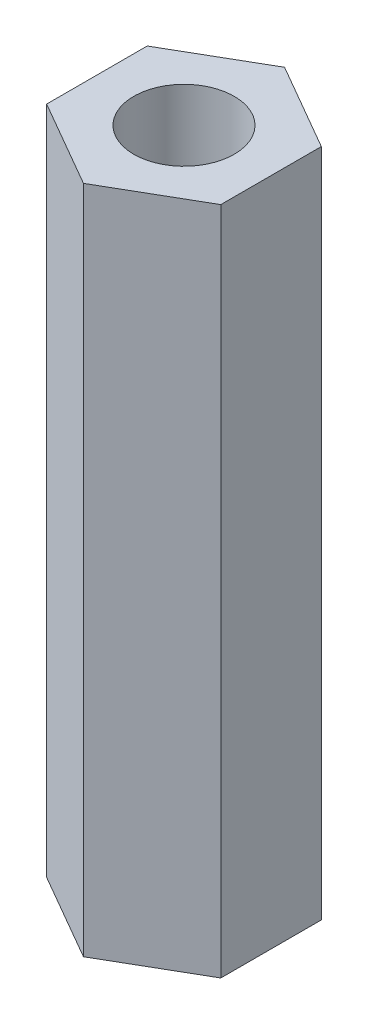
ISO-10303-21;
HEADER;
FILE_DESCRIPTION(('STEP AP214'),'2;1');
FILE_NAME('part.step','',(''),(''),'','','');
FILE_SCHEMA(('AUTOMOTIVE_DESIGN { 1 0 10303 214 1 1 1 1 }'));
ENDSEC;
DATA;
#1=APPLICATION_CONTEXT('core data for automotive mechanical design processes');
#2=APPLICATION_PROTOCOL_DEFINITION('international standard','automotive_design',2000,#1);
#3=PRODUCT_CONTEXT('',#1,'mechanical');
#4=PRODUCT('Part','Part','',(#3));
#5=PRODUCT_RELATED_PRODUCT_CATEGORY('part','',(#4));
#6=PRODUCT_DEFINITION_FORMATION('','',#4);
#7=PRODUCT_DEFINITION_CONTEXT('part definition',#1,'design');
#8=PRODUCT_DEFINITION('design','',#6,#7);
#9=PRODUCT_DEFINITION_SHAPE('','',#8);
#10=(LENGTH_UNIT() NAMED_UNIT(*) SI_UNIT(.MILLI.,.METRE.));
#11=(NAMED_UNIT(*) PLANE_ANGLE_UNIT() SI_UNIT($,.RADIAN.));
#12=(NAMED_UNIT(*) SI_UNIT($,.STERADIAN.) SOLID_ANGLE_UNIT());
#13=UNCERTAINTY_MEASURE_WITH_UNIT(LENGTH_MEASURE(1.E-05),#10,'distance_accuracy_value','');
#14=(GEOMETRIC_REPRESENTATION_CONTEXT(3) GLOBAL_UNCERTAINTY_ASSIGNED_CONTEXT((#13)) GLOBAL_UNIT_ASSIGNED_CONTEXT((#10,
#11,#12)) REPRESENTATION_CONTEXT('',''));
#15=CARTESIAN_POINT('',(0.,0.,0.));
#16=DIRECTION('',(0.,0.,1.));
#17=DIRECTION('',(1.,0.,0.));
#18=AXIS2_PLACEMENT_3D('',#15,#16,#17);
#19=CARTESIAN_POINT('',(0.,20.,0.));
#20=DIRECTION('',(0.,1.,0.));
#21=DIRECTION('',(0.,0.,1.));
#22=AXIS2_PLACEMENT_3D('',#19,#20,#21);
#23=PLANE('',#22);
#24=DIRECTION('',(-0.866025403784439,0.,-0.499999999999999));
#25=VECTOR('',#24,1.);
#26=CARTESIAN_POINT('',(2.6,20.,-1.50111069989303));
#27=LINE('',#26,#25);
#28=CARTESIAN_POINT('',(2.6,20.,-1.50111069989303));
#29=VERTEX_POINT('',#28);
#30=CARTESIAN_POINT('',(0.,20.,-3.00222139978605));
#31=VERTEX_POINT('',#30);
#32=EDGE_CURVE('E150',#29,#31,#27,.T.);
#33=ORIENTED_EDGE('',*,*,#32,.T.);
#34=DIRECTION('',(-0.866025403784438,0.,0.500000000000001));
#35=VECTOR('',#34,1.);
#36=CARTESIAN_POINT('',(0.,20.,-3.00222139978605));
#37=LINE('',#36,#35);
#38=CARTESIAN_POINT('',(-2.6,20.,-1.50111069989303));
#39=VERTEX_POINT('',#38);
#40=EDGE_CURVE('E98',#31,#39,#37,.T.);
#41=ORIENTED_EDGE('',*,*,#40,.T.);
#42=DIRECTION('',(0.,0.,1.));
#43=VECTOR('',#42,1.);
#44=CARTESIAN_POINT('',(-2.6,20.,-1.50111069989303));
#45=LINE('',#44,#43);
#46=CARTESIAN_POINT('',(-2.6,20.,1.50111069989303));
#47=VERTEX_POINT('',#46);
#48=EDGE_CURVE('E111',#39,#47,#45,.T.);
#49=ORIENTED_EDGE('',*,*,#48,.T.);
#50=DIRECTION('',(0.866025403784437,0.,0.500000000000003));
#51=VECTOR('',#50,1.);
#52=CARTESIAN_POINT('',(-2.6,20.,1.50111069989303));
#53=LINE('',#52,#51);
#54=CARTESIAN_POINT('',(0.,20.,3.00222139978606));
#55=VERTEX_POINT('',#54);
#56=EDGE_CURVE('E105',#47,#55,#53,.T.);
#57=ORIENTED_EDGE('',*,*,#56,.T.);
#58=DIRECTION('',(0.866025403784438,0.,-0.5));
#59=VECTOR('',#58,1.);
#60=CARTESIAN_POINT('',(0.,20.,3.00222139978606));
#61=LINE('',#60,#59);
#62=CARTESIAN_POINT('',(2.6,20.,1.50111069989303));
#63=VERTEX_POINT('',#62);
#64=EDGE_CURVE('E109',#55,#63,#61,.T.);
#65=ORIENTED_EDGE('',*,*,#64,.T.);
#66=DIRECTION('',(0.,0.,-1.));
#67=VECTOR('',#66,1.);
#68=CARTESIAN_POINT('',(2.6,20.,1.50111069989303));
#69=LINE('',#68,#67);
#70=EDGE_CURVE('E61',#63,#29,#69,.T.);
#71=ORIENTED_EDGE('',*,*,#70,.T.);
#72=EDGE_LOOP('',(#33,#41,#49,#57,#65,#71));
#73=FACE_BOUND('',#72,.T.);
#74=CARTESIAN_POINT('',(0.,20.,0.));
#75=DIRECTION('',(0.,1.,0.));
#76=DIRECTION('',(0.,0.,1.));
#77=AXIS2_PLACEMENT_3D('',#74,#75,#76);
#78=CIRCLE('',#77,1.5);
#79=CARTESIAN_POINT('',(0.,20.,1.5));
#80=VERTEX_POINT('',#79);
#81=EDGE_CURVE('E138',#80,#80,#78,.T.);
#82=ORIENTED_EDGE('',*,*,#81,.F.);
#83=EDGE_LOOP('',(#82));
#84=FACE_BOUND('',#83,.T.);
#85=ADVANCED_FACE('F43',(#73,#84),#23,.T.);
#86=CARTESIAN_POINT('',(0.,0.,0.));
#87=DIRECTION('',(0.,1.,0.));
#88=DIRECTION('',(0.,0.,1.));
#89=AXIS2_PLACEMENT_3D('',#86,#87,#88);
#90=PLANE('',#89);
#91=DIRECTION('',(-0.866025403784439,0.,-0.499999999999999));
#92=VECTOR('',#91,1.);
#93=CARTESIAN_POINT('',(2.6,0.,-1.50111069989303));
#94=LINE('',#93,#92);
#95=CARTESIAN_POINT('',(2.6,0.,-1.50111069989303));
#96=VERTEX_POINT('',#95);
#97=CARTESIAN_POINT('',(0.,0.,-3.00222139978605));
#98=VERTEX_POINT('',#97);
#99=EDGE_CURVE('E133',#96,#98,#94,.T.);
#100=ORIENTED_EDGE('',*,*,#99,.F.);
#101=DIRECTION('',(0.,0.,-1.));
#102=VECTOR('',#101,1.);
#103=CARTESIAN_POINT('',(2.6,0.,1.50111069989303));
#104=LINE('',#103,#102);
#105=CARTESIAN_POINT('',(2.6,0.,1.50111069989303));
#106=VERTEX_POINT('',#105);
#107=EDGE_CURVE('E90',#106,#96,#104,.T.);
#108=ORIENTED_EDGE('',*,*,#107,.F.);
#109=DIRECTION('',(0.866025403784438,0.,-0.5));
#110=VECTOR('',#109,1.);
#111=CARTESIAN_POINT('',(0.,0.,3.00222139978606));
#112=LINE('',#111,#110);
#113=CARTESIAN_POINT('',(0.,0.,3.00222139978606));
#114=VERTEX_POINT('',#113);
#115=EDGE_CURVE('E84',#114,#106,#112,.T.);
#116=ORIENTED_EDGE('',*,*,#115,.F.);
#117=DIRECTION('',(0.866025403784437,0.,0.500000000000003));
#118=VECTOR('',#117,1.);
#119=CARTESIAN_POINT('',(-2.6,0.,1.50111069989303));
#120=LINE('',#119,#118);
#121=CARTESIAN_POINT('',(-2.6,0.,1.50111069989303));
#122=VERTEX_POINT('',#121);
#123=EDGE_CURVE('E120',#122,#114,#120,.T.);
#124=ORIENTED_EDGE('',*,*,#123,.F.);
#125=DIRECTION('',(0.,0.,1.));
#126=VECTOR('',#125,1.);
#127=CARTESIAN_POINT('',(-2.6,0.,-1.50111069989303));
#128=LINE('',#127,#126);
#129=CARTESIAN_POINT('',(-2.6,0.,-1.50111069989303));
#130=VERTEX_POINT('',#129);
#131=EDGE_CURVE('E141',#130,#122,#128,.T.);
#132=ORIENTED_EDGE('',*,*,#131,.F.);
#133=DIRECTION('',(-0.866025403784438,0.,0.500000000000001));
#134=VECTOR('',#133,1.);
#135=CARTESIAN_POINT('',(0.,0.,-3.00222139978605));
#136=LINE('',#135,#134);
#137=EDGE_CURVE('E137',#98,#130,#136,.T.);
#138=ORIENTED_EDGE('',*,*,#137,.F.);
#139=EDGE_LOOP('',(#100,#108,#116,#124,#132,#138));
#140=FACE_BOUND('',#139,.T.);
#141=CARTESIAN_POINT('',(0.,0.,0.));
#142=DIRECTION('',(0.,1.,0.));
#143=DIRECTION('',(0.,0.,1.));
#144=AXIS2_PLACEMENT_3D('',#141,#142,#143);
#145=CIRCLE('',#144,1.5);
#146=CARTESIAN_POINT('',(0.,0.,1.5));
#147=VERTEX_POINT('',#146);
#148=EDGE_CURVE('E265',#147,#147,#145,.T.);
#149=ORIENTED_EDGE('',*,*,#148,.T.);
#150=EDGE_LOOP('',(#149));
#151=FACE_BOUND('',#150,.T.);
#152=ADVANCED_FACE('F163',(#140,#151),#90,.F.);
#153=CARTESIAN_POINT('',(2.6,20.,-1.50111069989303));
#154=DIRECTION('',(-0.499999999999999,0.,0.866025403784439));
#155=DIRECTION('',(0.866025403784439,0.,0.499999999999999));
#156=AXIS2_PLACEMENT_3D('',#153,#154,#155);
#157=PLANE('',#156);
#158=ORIENTED_EDGE('',*,*,#99,.T.);
#159=DIRECTION('',(0.,-1.,0.));
#160=VECTOR('',#159,1.);
#161=CARTESIAN_POINT('',(0.,20.,-3.00222139978605));
#162=LINE('',#161,#160);
#163=EDGE_CURVE('E11',#31,#98,#162,.T.);
#164=ORIENTED_EDGE('',*,*,#163,.F.);
#165=ORIENTED_EDGE('',*,*,#32,.F.);
#166=DIRECTION('',(0.,-1.,0.));
#167=VECTOR('',#166,1.);
#168=CARTESIAN_POINT('',(2.6,20.,-1.50111069989303));
#169=LINE('',#168,#167);
#170=EDGE_CURVE('E129',#29,#96,#169,.T.);
#171=ORIENTED_EDGE('',*,*,#170,.T.);
#172=EDGE_LOOP('',(#158,#164,#165,#171));
#173=FACE_BOUND('',#172,.T.);
#174=ADVANCED_FACE('F45',(#173),#157,.F.);
#175=CARTESIAN_POINT('',(0.,20.,-3.00222139978605));
#176=DIRECTION('',(0.500000000000001,0.,0.866025403784438));
#177=DIRECTION('',(0.866025403784438,0.,-0.500000000000001));
#178=AXIS2_PLACEMENT_3D('',#175,#176,#177);
#179=PLANE('',#178);
#180=ORIENTED_EDGE('',*,*,#137,.T.);
#181=DIRECTION('',(0.,-1.,0.));
#182=VECTOR('',#181,1.);
#183=CARTESIAN_POINT('',(-2.6,20.,-1.50111069989303));
#184=LINE('',#183,#182);
#185=EDGE_CURVE('E53',#39,#130,#184,.T.);
#186=ORIENTED_EDGE('',*,*,#185,.F.);
#187=ORIENTED_EDGE('',*,*,#40,.F.);
#188=ORIENTED_EDGE('',*,*,#163,.T.);
#189=EDGE_LOOP('',(#180,#186,#187,#188));
#190=FACE_BOUND('',#189,.T.);
#191=ADVANCED_FACE('F188',(#190),#179,.F.);
#192=CARTESIAN_POINT('',(-2.6,20.,-1.50111069989303));
#193=DIRECTION('',(1.,0.,0.));
#194=DIRECTION('',(0.,0.,-1.));
#195=AXIS2_PLACEMENT_3D('',#192,#193,#194);
#196=PLANE('',#195);
#197=ORIENTED_EDGE('',*,*,#131,.T.);
#198=DIRECTION('',(0.,-1.,0.));
#199=VECTOR('',#198,1.);
#200=CARTESIAN_POINT('',(-2.6,20.,1.50111069989303));
#201=LINE('',#200,#199);
#202=EDGE_CURVE('E122',#47,#122,#201,.T.);
#203=ORIENTED_EDGE('',*,*,#202,.F.);
#204=ORIENTED_EDGE('',*,*,#48,.F.);
#205=ORIENTED_EDGE('',*,*,#185,.T.);
#206=EDGE_LOOP('',(#197,#203,#204,#205));
#207=FACE_BOUND('',#206,.T.);
#208=ADVANCED_FACE('F160',(#207),#196,.F.);
#209=CARTESIAN_POINT('',(-2.6,20.,1.50111069989303));
#210=DIRECTION('',(0.500000000000003,0.,-0.866025403784437));
#211=DIRECTION('',(-0.866025403784437,0.,-0.500000000000003));
#212=AXIS2_PLACEMENT_3D('',#209,#210,#211);
#213=PLANE('',#212);
#214=ORIENTED_EDGE('',*,*,#123,.T.);
#215=DIRECTION('',(0.,-1.,0.));
#216=VECTOR('',#215,1.);
#217=CARTESIAN_POINT('',(0.,20.,3.00222139978606));
#218=LINE('',#217,#216);
#219=EDGE_CURVE('E117',#55,#114,#218,.T.);
#220=ORIENTED_EDGE('',*,*,#219,.F.);
#221=ORIENTED_EDGE('',*,*,#56,.F.);
#222=ORIENTED_EDGE('',*,*,#202,.T.);
#223=EDGE_LOOP('',(#214,#220,#221,#222));
#224=FACE_BOUND('',#223,.T.);
#225=ADVANCED_FACE('F118',(#224),#213,.F.);
#226=CARTESIAN_POINT('',(0.,20.,3.00222139978606));
#227=DIRECTION('',(-0.5,0.,-0.866025403784438));
#228=DIRECTION('',(-0.866025403784439,0.,0.5));
#229=AXIS2_PLACEMENT_3D('',#226,#227,#228);
#230=PLANE('',#229);
#231=ORIENTED_EDGE('',*,*,#115,.T.);
#232=DIRECTION('',(0.,-1.,0.));
#233=VECTOR('',#232,1.);
#234=CARTESIAN_POINT('',(2.6,20.,1.50111069989303));
#235=LINE('',#234,#233);
#236=EDGE_CURVE('E123',#63,#106,#235,.T.);
#237=ORIENTED_EDGE('',*,*,#236,.F.);
#238=ORIENTED_EDGE('',*,*,#64,.F.);
#239=ORIENTED_EDGE('',*,*,#219,.T.);
#240=EDGE_LOOP('',(#231,#237,#238,#239));
#241=FACE_BOUND('',#240,.T.);
#242=ADVANCED_FACE('F125',(#241),#230,.F.);
#243=CARTESIAN_POINT('',(2.6,20.,1.50111069989303));
#244=DIRECTION('',(-1.,0.,0.));
#245=DIRECTION('',(0.,0.,1.));
#246=AXIS2_PLACEMENT_3D('',#243,#244,#245);
#247=PLANE('',#246);
#248=ORIENTED_EDGE('',*,*,#107,.T.);
#249=ORIENTED_EDGE('',*,*,#170,.F.);
#250=ORIENTED_EDGE('',*,*,#70,.F.);
#251=ORIENTED_EDGE('',*,*,#236,.T.);
#252=EDGE_LOOP('',(#248,#249,#250,#251));
#253=FACE_BOUND('',#252,.T.);
#254=ADVANCED_FACE('F168',(#253),#247,.F.);
#255=CARTESIAN_POINT('',(0.,20.,0.));
#256=DIRECTION('',(0.,-1.,0.));
#257=DIRECTION('',(0.,0.,-1.));
#258=AXIS2_PLACEMENT_3D('',#255,#256,#257);
#259=CYLINDRICAL_SURFACE('',#258,1.5);
#260=ORIENTED_EDGE('',*,*,#81,.T.);
#261=EDGE_LOOP('',(#260));
#262=FACE_BOUND('',#261,.T.);
#263=ORIENTED_EDGE('',*,*,#148,.F.);
#264=EDGE_LOOP('',(#263));
#265=FACE_BOUND('',#264,.T.);
#266=ADVANCED_FACE('F170',(#262,#265),#259,.F.);
#267=CLOSED_SHELL('',(#85,#152,#174,#191,#208,#225,#242,#254,#266));
#268=MANIFOLD_SOLID_BREP('B2',#267);
#269=ADVANCED_BREP_SHAPE_REPRESENTATION('',(#18,#268),#14);
#270=SHAPE_DEFINITION_REPRESENTATION(#9,#269);
ENDSEC;
END-ISO-10303-21;
